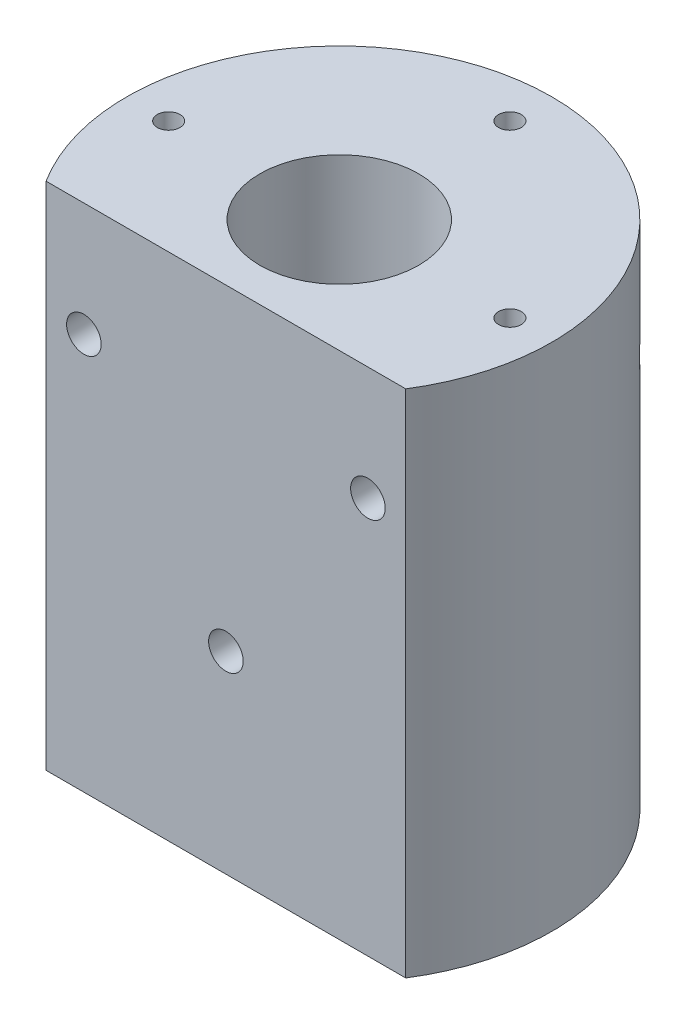
ISO-10303-21;
HEADER;
FILE_DESCRIPTION(('STEP AP214'),'2;1');
FILE_NAME('part.step','',(''),(''),'','','');
FILE_SCHEMA(('AUTOMOTIVE_DESIGN { 1 0 10303 214 1 1 1 1 }'));
ENDSEC;
DATA;
#1=APPLICATION_CONTEXT('core data for automotive mechanical design processes');
#2=APPLICATION_PROTOCOL_DEFINITION('international standard','automotive_design',2000,#1);
#3=PRODUCT_CONTEXT('',#1,'mechanical');
#4=PRODUCT('Part','Part','',(#3));
#5=PRODUCT_RELATED_PRODUCT_CATEGORY('part','',(#4));
#6=PRODUCT_DEFINITION_FORMATION('','',#4);
#7=PRODUCT_DEFINITION_CONTEXT('part definition',#1,'design');
#8=PRODUCT_DEFINITION('design','',#6,#7);
#9=PRODUCT_DEFINITION_SHAPE('','',#8);
#10=(LENGTH_UNIT() NAMED_UNIT(*) SI_UNIT(.MILLI.,.METRE.));
#11=(NAMED_UNIT(*) PLANE_ANGLE_UNIT() SI_UNIT($,.RADIAN.));
#12=(NAMED_UNIT(*) SI_UNIT($,.STERADIAN.) SOLID_ANGLE_UNIT());
#13=UNCERTAINTY_MEASURE_WITH_UNIT(LENGTH_MEASURE(1.E-05),#10,'distance_accuracy_value','');
#14=(GEOMETRIC_REPRESENTATION_CONTEXT(3) GLOBAL_UNCERTAINTY_ASSIGNED_CONTEXT((#13)) GLOBAL_UNIT_ASSIGNED_CONTEXT((#10,
#11,#12)) REPRESENTATION_CONTEXT('',''));
#15=CARTESIAN_POINT('',(0.,0.,0.));
#16=DIRECTION('',(0.,0.,1.));
#17=DIRECTION('',(1.,0.,0.));
#18=AXIS2_PLACEMENT_3D('',#15,#16,#17);
#19=CARTESIAN_POINT('',(0.,-90.,0.));
#20=DIRECTION('',(0.,1.,0.));
#21=DIRECTION('',(0.,0.,1.));
#22=AXIS2_PLACEMENT_3D('',#19,#20,#21);
#23=CYLINDRICAL_SURFACE('',#22,11.2);
#24=CARTESIAN_POINT('',(3.05,-55.95,10.776711001043));
#25=CARTESIAN_POINT('',(3.04999623145743,-56.1178751772108,10.7767137716955));
#26=CARTESIAN_POINT('',(3.03609274985436,-56.2857896702675,10.7806765296159));
#27=CARTESIAN_POINT('',(2.98095760891276,-56.6167595821179,10.7960494721364));
#28=CARTESIAN_POINT('',(2.9397130011288,-56.7798126603492,10.8074631853848));
#29=CARTESIAN_POINT('',(2.8313597380252,-57.0962236473457,10.8363516243342));
#30=CARTESIAN_POINT('',(2.76428851158382,-57.2495952142413,10.8538175752615));
#31=CARTESIAN_POINT('',(2.60630419902693,-57.5429355010534,10.8928312225758));
#32=CARTESIAN_POINT('',(2.5153889717962,-57.6829030157871,10.9143792854753));
#33=CARTESIAN_POINT('',(2.30976133248977,-57.9491124975855,10.9597590800106));
#34=CARTESIAN_POINT('',(2.19453844264803,-58.0749531060746,10.983632672365));
#35=CARTESIAN_POINT('',(1.94466348133748,-58.3057842699961,11.0306128843461));
#36=CARTESIAN_POINT('',(1.81000932479086,-58.4107725849903,11.053719421336));
#37=CARTESIAN_POINT('',(1.52229940129861,-58.5986037356187,11.0970305267987));
#38=CARTESIAN_POINT('',(1.36897303502999,-58.681045899208,11.1171799644357));
#39=CARTESIAN_POINT('',(1.04999469564471,-58.8188286639382,11.1518252926287));
#40=CARTESIAN_POINT('',(0.884344899474339,-58.8741740387204,11.166322178903));
#41=CARTESIAN_POINT('',(0.549612909312948,-58.9548884727968,11.1877329737454));
#42=CARTESIAN_POINT('',(0.38070666942633,-58.9809406624667,11.1948194087348));
#43=CARTESIAN_POINT('',(0.0407822388697001,-59.0044802025124,11.201214773848));
#44=CARTESIAN_POINT('',(-0.130235578567834,-59.0019725307902,11.2005250593327));
#45=CARTESIAN_POINT('',(-0.464767685045948,-58.9689409592804,11.1915715290715));
#46=CARTESIAN_POINT('',(-0.6283610380743,-58.9391553846756,11.1835073254099));
#47=CARTESIAN_POINT('',(-0.9481333287752,-58.8536084415776,11.1609475911081));
#48=CARTESIAN_POINT('',(-1.10431183423155,-58.7978455608943,11.1464516860681));
#49=CARTESIAN_POINT('',(-1.40668474143316,-58.6613719340503,11.1123645238312));
#50=CARTESIAN_POINT('',(-1.55276056241005,-58.5804116284263,11.0927226222307));
#51=CARTESIAN_POINT('',(-1.82950236308129,-58.3960337330169,11.0504546005324));
#52=CARTESIAN_POINT('',(-1.9601652203117,-58.2926116047773,11.0278278777091));
#53=CARTESIAN_POINT('',(-2.20677954911504,-58.0623406038335,10.9811836461871));
#54=CARTESIAN_POINT('',(-2.3221269527727,-57.9348483403712,10.9571448008845));
#55=CARTESIAN_POINT('',(-2.52995523992452,-57.6620826023754,10.9110352423874));
#56=CARTESIAN_POINT('',(-2.62243460284276,-57.5168079463882,10.8889646601318));
#57=CARTESIAN_POINT('',(-2.78238811432387,-57.2112466116065,10.8492020546834));
#58=CARTESIAN_POINT('',(-2.8496913763829,-57.0508662719983,10.8315402161349));
#59=CARTESIAN_POINT('',(-2.95617819602833,-56.7204644088784,10.8029664454447));
#60=CARTESIAN_POINT('',(-2.99536907257209,-56.5504454072044,10.792052756549));
#61=CARTESIAN_POINT('',(-3.04346324801638,-56.2112582796131,10.7785871162836));
#62=CARTESIAN_POINT('',(-3.05327043598141,-56.04222808359,10.7757857117529));
#63=CARTESIAN_POINT('',(-3.04481474777144,-55.7049416408835,10.7781781253564));
#64=CARTESIAN_POINT('',(-3.02655500532632,-55.5366853099003,10.7833710509074));
#65=CARTESIAN_POINT('',(-2.96328205321478,-55.2092509242064,10.8009254057997));
#66=CARTESIAN_POINT('',(-2.91881835419412,-55.0499580081829,10.813139472312));
#67=CARTESIAN_POINT('',(-2.80502059397653,-54.7410925618929,10.8432145080758));
#68=CARTESIAN_POINT('',(-2.73568318323927,-54.591521343974,10.8610762378138));
#69=CARTESIAN_POINT('',(-2.57229099541142,-54.3025804213111,10.9009414192264));
#70=CARTESIAN_POINT('',(-2.47770882751838,-54.1635209687899,10.9230299982747));
#71=CARTESIAN_POINT('',(-2.26716116792455,-53.9029155805311,10.9686626891702));
#72=CARTESIAN_POINT('',(-2.15119147796552,-53.7813730916406,10.9922070861828));
#73=CARTESIAN_POINT('',(-1.8969685487007,-53.5554672956782,11.0389620456436));
#74=CARTESIAN_POINT('',(-1.75814661166884,-53.4517360674235,11.0621408797072));
#75=CARTESIAN_POINT('',(-1.46453848744185,-53.2690457722021,11.1048232958593));
#76=CARTESIAN_POINT('',(-1.30975315027867,-53.1900853871218,11.124327073484));
#77=CARTESIAN_POINT('',(-0.989700904868547,-53.0599134687701,11.1573360820879));
#78=CARTESIAN_POINT('',(-0.824523737653365,-53.0084932485261,11.1708862815792));
#79=CARTESIAN_POINT('',(-0.487446997534502,-52.9342647052504,11.190659568612));
#80=CARTESIAN_POINT('',(-0.315548992797321,-52.9114497483807,11.1968843549674));
#81=CARTESIAN_POINT('',(0.024195701121137,-52.8955096938223,11.2012214285457));
#82=CARTESIAN_POINT('',(0.19199634950391,-52.9014592685654,11.1995865629794));
#83=CARTESIAN_POINT('',(0.52411475476244,-52.9407205883033,11.1889637448709));
#84=CARTESIAN_POINT('',(0.688432652260242,-52.9740312263809,11.1799760897927));
#85=CARTESIAN_POINT('',(1.00775762994188,-53.0665370656362,11.1557114878272));
#86=CARTESIAN_POINT('',(1.16282499723325,-53.1255374181561,11.1404819339187));
#87=CARTESIAN_POINT('',(1.46094745772513,-53.2675743400465,11.1053225720471));
#88=CARTESIAN_POINT('',(1.60400080800345,-53.350614389209,11.0853920836922));
#89=CARTESIAN_POINT('',(1.87831333408396,-53.5410416875994,11.0422716782839));
#90=CARTESIAN_POINT('',(2.00913842610765,-53.649037253602,11.0190070279768));
#91=CARTESIAN_POINT('',(2.2511218193937,-53.8851658380765,10.972131702392));
#92=CARTESIAN_POINT('',(2.36227486227055,-54.0133042235411,10.9485209364176));
#93=CARTESIAN_POINT('',(2.56431965270475,-54.2896578608592,10.9029932749763));
#94=CARTESIAN_POINT('',(2.6546812876738,-54.4382700510584,10.8811284100939));
#95=CARTESIAN_POINT('',(2.80901111907589,-54.7491545440612,10.8423166488308));
#96=CARTESIAN_POINT('',(2.87299587111497,-54.9114182011871,10.8253666695811));
#97=CARTESIAN_POINT('',(2.96479287026685,-55.2191356959455,10.8005504268194));
#98=CARTESIAN_POINT('',(2.99666853431029,-55.3633091105453,10.7916848377547));
#99=CARTESIAN_POINT('',(3.03927242631461,-55.6549785093284,10.7797642725544));
#100=CARTESIAN_POINT('',(3.05000331173282,-55.8024740736299,10.7767085662393));
#101=CARTESIAN_POINT('',(3.05,-55.95,10.776711001043));
#102=B_SPLINE_CURVE_WITH_KNOTS('',3,(#24,#25,#26,#27,#28,#29,#30,#31,#32,#33,#34,#35,#36,#37,
#38,#39,#40,#41,#42,#43,#44,#45,#46,#47,#48,#49,#50,#51,#52,#53,#54,#55,#56,#57,#58,#59,#60,#61,
#62,#63,#64,#65,#66,#67,#68,#69,#70,#71,#72,#73,#74,#75,#76,#77,#78,#79,#80,#81,#82,#83,#84,#85,
#86,#87,#88,#89,#90,#91,#92,#93,#94,#95,#96,#97,#98,#99,#100,#101),.UNSPECIFIED.,.T.,.F.,(4,2,2,
2,2,2,2,2,2,2,2,2,2,2,2,2,2,2,2,2,2,2,2,2,2,2,2,2,2,2,2,2,2,2,2,2,2,2,4),(0.,0.503082789953881,
1.00640400455332,1.50899851643544,2.01163817516342,2.52612725611762,3.04067158558385,
3.56384013602669,4.08691648667009,4.59752364778962,5.10804181290319,5.60513763323398,
6.10226239411082,6.60447646967943,7.10679211311893,7.62517107554222,8.14358449753063,
8.66545548847417,9.1871905628421,9.69270246382814,10.1981579274815,10.693373040537,
11.18865486523,11.6952263401697,12.2018973584719,12.7239197379103,13.2459143346197,
13.7638954280673,14.2817563744414,14.7830711842295,15.2843657138626,15.7819225619858,
16.279551468456,16.7909046262504,17.3023942641936,17.8257549594064,18.3487866622021,
18.7909430622867,19.2330438889954),.UNSPECIFIED.);
#103=CARTESIAN_POINT('',(3.05,-55.95,10.776711001043));
#104=VERTEX_POINT('',#103);
#105=EDGE_CURVE('E166',#104,#104,#102,.T.);
#106=ORIENTED_EDGE('',*,*,#105,.F.);
#107=EDGE_LOOP('',(#106));
#108=FACE_BOUND('',#107,.T.);
#109=CARTESIAN_POINT('',(0.,-90.,0.));
#110=DIRECTION('',(0.,1.,0.));
#111=DIRECTION('',(0.,0.,1.));
#112=AXIS2_PLACEMENT_3D('',#109,#110,#111);
#113=CIRCLE('',#112,11.2);
#114=CARTESIAN_POINT('',(0.,-90.,11.2));
#115=VERTEX_POINT('',#114);
#116=EDGE_CURVE('E85',#115,#115,#113,.T.);
#117=ORIENTED_EDGE('',*,*,#116,.F.);
#118=EDGE_LOOP('',(#117));
#119=FACE_BOUND('',#118,.T.);
#120=CARTESIAN_POINT('',(0.,-50.,0.));
#121=DIRECTION('',(0.,1.,0.));
#122=DIRECTION('',(0.,0.,1.));
#123=AXIS2_PLACEMENT_3D('',#120,#121,#122);
#124=CIRCLE('',#123,11.2);
#125=CARTESIAN_POINT('',(0.,-50.,11.2));
#126=VERTEX_POINT('',#125);
#127=EDGE_CURVE('E172',#126,#126,#124,.T.);
#128=ORIENTED_EDGE('',*,*,#127,.T.);
#129=EDGE_LOOP('',(#128));
#130=FACE_BOUND('',#129,.T.);
#131=ADVANCED_FACE('F39',(#108,#119,#130),#23,.F.);
#132=CARTESIAN_POINT('',(0.,-90.,20.));
#133=DIRECTION('',(0.,0.,1.));
#134=DIRECTION('',(1.,0.,0.));
#135=AXIS2_PLACEMENT_3D('',#132,#133,#134);
#136=PLANE('',#135);
#137=CARTESIAN_POINT('',(0.,-55.95,20.));
#138=DIRECTION('',(0.,0.,1.));
#139=DIRECTION('',(1.,0.,0.));
#140=AXIS2_PLACEMENT_3D('',#137,#138,#139);
#141=CIRCLE('',#140,3.05);
#142=CARTESIAN_POINT('',(3.05,-55.95,20.));
#143=VERTEX_POINT('',#142);
#144=EDGE_CURVE('E229',#143,#143,#141,.T.);
#145=ORIENTED_EDGE('',*,*,#144,.F.);
#146=EDGE_LOOP('',(#145));
#147=FACE_BOUND('',#146,.T.);
#148=CARTESIAN_POINT('',(25.05,-20.05,20.));
#149=DIRECTION('',(0.,0.,1.));
#150=DIRECTION('',(1.,0.,0.));
#151=AXIS2_PLACEMENT_3D('',#148,#149,#150);
#152=CIRCLE('',#151,3.05);
#153=CARTESIAN_POINT('',(28.1,-20.05,20.));
#154=VERTEX_POINT('',#153);
#155=EDGE_CURVE('E92',#154,#154,#152,.T.);
#156=ORIENTED_EDGE('',*,*,#155,.F.);
#157=EDGE_LOOP('',(#156));
#158=FACE_BOUND('',#157,.T.);
#159=CARTESIAN_POINT('',(-25.05,-20.05,20.));
#160=DIRECTION('',(0.,0.,1.));
#161=DIRECTION('',(1.,0.,0.));
#162=AXIS2_PLACEMENT_3D('',#159,#160,#161);
#163=CIRCLE('',#162,3.05);
#164=CARTESIAN_POINT('',(-22.,-20.05,20.));
#165=VERTEX_POINT('',#164);
#166=EDGE_CURVE('E224',#165,#165,#163,.T.);
#167=ORIENTED_EDGE('',*,*,#166,.F.);
#168=EDGE_LOOP('',(#167));
#169=FACE_BOUND('',#168,.T.);
#170=DIRECTION('',(1.,0.,0.));
#171=VECTOR('',#170,1.);
#172=CARTESIAN_POINT('',(0.,0.,20.));
#173=LINE('',#172,#171);
#174=CARTESIAN_POINT('',(-31.7214438511238,0.,20.));
#175=VERTEX_POINT('',#174);
#176=CARTESIAN_POINT('',(31.7214438511238,0.,20.));
#177=VERTEX_POINT('',#176);
#178=EDGE_CURVE('E75',#175,#177,#173,.T.);
#179=ORIENTED_EDGE('',*,*,#178,.F.);
#180=DIRECTION('',(0.,1.,0.));
#181=VECTOR('',#180,1.);
#182=CARTESIAN_POINT('',(-31.7214438511238,-90.,20.));
#183=LINE('',#182,#181);
#184=CARTESIAN_POINT('',(-31.7214438511238,-90.,20.));
#185=VERTEX_POINT('',#184);
#186=EDGE_CURVE('E11',#185,#175,#183,.T.);
#187=ORIENTED_EDGE('',*,*,#186,.F.);
#188=DIRECTION('',(1.,0.,0.));
#189=VECTOR('',#188,1.);
#190=CARTESIAN_POINT('',(0.,-90.,20.));
#191=LINE('',#190,#189);
#192=CARTESIAN_POINT('',(31.7214438511238,-90.,20.));
#193=VERTEX_POINT('',#192);
#194=EDGE_CURVE('E80',#185,#193,#191,.T.);
#195=ORIENTED_EDGE('',*,*,#194,.T.);
#196=DIRECTION('',(0.,1.,0.));
#197=VECTOR('',#196,1.);
#198=CARTESIAN_POINT('',(31.7214438511238,-90.,20.));
#199=LINE('',#198,#197);
#200=EDGE_CURVE('E53',#193,#177,#199,.T.);
#201=ORIENTED_EDGE('',*,*,#200,.T.);
#202=EDGE_LOOP('',(#179,#187,#195,#201));
#203=FACE_BOUND('',#202,.T.);
#204=ADVANCED_FACE('F41',(#147,#158,#169,#203),#136,.T.);
#205=CARTESIAN_POINT('',(0.,-90.,0.));
#206=DIRECTION('',(0.,1.,0.));
#207=DIRECTION('',(0.,0.,1.));
#208=AXIS2_PLACEMENT_3D('',#205,#206,#207);
#209=CYLINDRICAL_SURFACE('',#208,37.5);
#210=CARTESIAN_POINT('',(28.1,-20.05,-24.83223711227));
#211=CARTESIAN_POINT('',(28.0999998195087,-20.1161856596695,-24.8322373521075));
#212=CARTESIAN_POINT('',(28.0978404371829,-20.1823801402648,-24.8346815110146));
#213=CARTESIAN_POINT('',(28.0892566686426,-20.3141659831752,-24.8443897245246));
#214=CARTESIAN_POINT('',(28.0828297758762,-20.3797569680541,-24.8516566117891));
#215=CARTESIAN_POINT('',(28.0658508514684,-20.509839559993,-24.8708298888446));
#216=CARTESIAN_POINT('',(28.0552912024331,-20.5743289061392,-24.88274484571));
#217=CARTESIAN_POINT('',(28.0302908631894,-20.7015993845057,-24.9109041907154));
#218=CARTESIAN_POINT('',(28.0158481562757,-20.7643796103658,-24.9271508285211));
#219=CARTESIAN_POINT('',(27.9674433855617,-20.9483053475669,-24.9814820979298));
#220=CARTESIAN_POINT('',(27.9282148203732,-21.0664158925546,-25.0253741504981));
#221=CARTESIAN_POINT('',(27.8381907308289,-21.292311218697,-25.1254784045173));
#222=CARTESIAN_POINT('',(27.787392910071,-21.4000939438219,-25.1816930518187));
#223=CARTESIAN_POINT('',(27.648757248179,-21.6560650707893,-25.3339962865044));
#224=CARTESIAN_POINT('',(27.5550848382698,-21.7975794077656,-25.4359848311525));
#225=CARTESIAN_POINT('',(27.3524061595352,-22.0571550450112,-25.6538129052575));
#226=CARTESIAN_POINT('',(27.2433605534183,-22.1751542437634,-25.7696878497808));
#227=CARTESIAN_POINT('',(27.0480449925933,-22.357036668635,-25.9743520423836));
#228=CARTESIAN_POINT('',(26.9646411773337,-22.4265792892263,-26.0609528953215));
#229=CARTESIAN_POINT('',(26.7930862158046,-22.5551243399789,-26.2372951204349));
#230=CARTESIAN_POINT('',(26.7049332218278,-22.6141226286731,-26.327037710104));
#231=CARTESIAN_POINT('',(26.5246182441713,-22.7218975796694,-26.5086968899721));
#232=CARTESIAN_POINT('',(26.4324541544405,-22.7706687920487,-26.6006146103941));
#233=CARTESIAN_POINT('',(26.2448106000824,-22.85813816658,-26.7857673420476));
#234=CARTESIAN_POINT('',(26.1493315214923,-22.8968374971931,-26.8790021991509));
#235=CARTESIAN_POINT('',(25.8542616555506,-22.9995284881297,-27.1639974186014));
#236=CARTESIAN_POINT('',(25.6500891372137,-23.0477194362644,-27.3569531504325));
#237=CARTESIAN_POINT('',(25.2345043548916,-23.1016121853976,-27.7407613675125));
#238=CARTESIAN_POINT('',(25.0230947265446,-23.1073292927328,-27.9316145856861));
#239=CARTESIAN_POINT('',(24.6130224985853,-23.0750258469197,-28.2934356185262));
#240=CARTESIAN_POINT('',(24.414523021987,-23.0400879160105,-28.4648521818683));
#241=CARTESIAN_POINT('',(24.0208875304742,-22.9283992945491,-28.7977971206304));
#242=CARTESIAN_POINT('',(23.8257483422855,-22.8516905690715,-28.9593352395715));
#243=CARTESIAN_POINT('',(23.4882024824949,-22.6751067654736,-29.2333861340314));
#244=CARTESIAN_POINT('',(23.3436241231622,-22.5840146953907,-29.3488761980603));
#245=CARTESIAN_POINT('',(23.0662636700093,-22.3732553349133,-29.5673551426022));
#246=CARTESIAN_POINT('',(22.9334663298407,-22.2536257387442,-29.6703602456544));
#247=CARTESIAN_POINT('',(22.7085469370728,-22.0101989035103,-29.842725532065));
#248=CARTESIAN_POINT('',(22.6134177616887,-21.8911039998821,-29.9147986507431));
#249=CARTESIAN_POINT('',(22.4394320233246,-21.6347206834464,-30.0455276179619));
#250=CARTESIAN_POINT('',(22.360570764788,-21.4974375393173,-30.1041873386653));
#251=CARTESIAN_POINT('',(22.2576210139409,-21.2795048298758,-30.1802942414957));
#252=CARTESIAN_POINT('',(22.2257570215307,-21.2045071661399,-30.2037583722552));
#253=CARTESIAN_POINT('',(22.1678210872249,-21.0511248090132,-30.2463055045333));
#254=CARTESIAN_POINT('',(22.1417461855634,-20.9727418709988,-30.2653907449976));
#255=CARTESIAN_POINT('',(22.0958699883706,-20.8132165740171,-30.2989000148495));
#256=CARTESIAN_POINT('',(22.0760663746865,-20.732075246986,-30.3133257666351));
#257=CARTESIAN_POINT('',(22.0431019683565,-20.5677800306774,-30.3373047719201));
#258=CARTESIAN_POINT('',(22.0299401671024,-20.4846264489868,-30.3468587652344));
#259=CARTESIAN_POINT('',(22.0033765277573,-20.2550454197401,-30.3661312998705));
#260=CARTESIAN_POINT('',(21.9969870225568,-20.107276039591,-30.3707525098668));
#261=CARTESIAN_POINT('',(22.0056663297438,-19.8128244397207,-30.3644637831235));
#262=CARTESIAN_POINT('',(22.0207277073692,-19.6661418610297,-30.3535592275322));
#263=CARTESIAN_POINT('',(22.0699332703524,-19.3860486034215,-30.3177982696899));
#264=CARTESIAN_POINT('',(22.1030118751488,-19.2523479013093,-30.2937206285445));
#265=CARTESIAN_POINT('',(22.1857171007936,-18.993163196191,-30.2332030148431));
#266=CARTESIAN_POINT('',(22.2353458891609,-18.8676802720148,-30.1967614230135));
#267=CARTESIAN_POINT('',(22.3521794902719,-18.6202927812203,-30.1103906785372));
#268=CARTESIAN_POINT('',(22.4202450307375,-18.4990306714115,-30.0597953564227));
#269=CARTESIAN_POINT('',(22.569361107287,-18.2702224759387,-29.947998633655));
#270=CARTESIAN_POINT('',(22.650416475327,-18.1626815211122,-29.8867932855893));
#271=CARTESIAN_POINT('',(22.8350242932606,-17.947807088688,-29.7460408348665));
#272=CARTESIAN_POINT('',(22.9401359648307,-17.8427177793076,-29.6651220491263));
#273=CARTESIAN_POINT('',(23.1598314385953,-17.6518789487461,-29.4939263335361));
#274=CARTESIAN_POINT('',(23.2744233049135,-17.5661461287501,-29.4036414196653));
#275=CARTESIAN_POINT('',(23.5664856756204,-17.377028949967,-29.1705361697686));
#276=CARTESIAN_POINT('',(23.7477539039044,-17.2849000689837,-29.0232874789343));
#277=CARTESIAN_POINT('',(24.1164105739104,-17.1396228727253,-28.7177010782965));
#278=CARTESIAN_POINT('',(24.3038075292061,-17.0865314159675,-28.5593475601621));
#279=CARTESIAN_POINT('',(24.6817277086082,-17.016137929356,-28.2334103384766));
#280=CARTESIAN_POINT('',(24.8722584017279,-16.9993396423154,-28.0657294493971));
#281=CARTESIAN_POINT('',(25.2498416913831,-17.0007003907259,-27.7265198532235));
#282=CARTESIAN_POINT('',(25.4368928289233,-17.0188737706204,-27.5549895957438));
#283=CARTESIAN_POINT('',(25.7304420704883,-17.0747627396985,-27.2803440273359));
#284=CARTESIAN_POINT('',(25.8392070783889,-17.1017408263031,-27.1773335990333));
#285=CARTESIAN_POINT('',(26.0536443890465,-17.1676774174305,-26.9718304440323));
#286=CARTESIAN_POINT('',(26.1593159355422,-17.2066388251781,-26.8693378489134));
#287=CARTESIAN_POINT('',(26.3668028665992,-17.2965810686194,-26.6657613252146));
#288=CARTESIAN_POINT('',(26.4686190196921,-17.3475594940538,-26.5646771184539));
#289=CARTESIAN_POINT('',(26.6675808386778,-17.4617420240825,-26.3649390203655));
#290=CARTESIAN_POINT('',(26.7647284484441,-17.524940984286,-26.2662841260194));
#291=CARTESIAN_POINT('',(26.990172216813,-17.6910241323244,-26.0348951723056));
#292=CARTESIAN_POINT('',(27.1159132302929,-17.7997886184198,-25.9038054636767));
#293=CARTESIAN_POINT('',(27.3530526647995,-18.043201022713,-25.6532673268032));
#294=CARTESIAN_POINT('',(27.4644771650734,-18.1778007301528,-25.5337978302994));
#295=CARTESIAN_POINT('',(27.6398835966318,-18.4338184445871,-25.3436140528794));
#296=CARTESIAN_POINT('',(27.7085040164129,-18.5487632230963,-25.2685045725488));
#297=CARTESIAN_POINT('',(27.8323904631592,-18.793218026172,-25.1319819380419));
#298=CARTESIAN_POINT('',(27.8876717943678,-18.922711106614,-25.0705530940529));
#299=CARTESIAN_POINT('',(27.9717276826518,-19.1672761009347,-24.9767013206145));
#300=CARTESIAN_POINT('',(28.0035996690931,-19.2799884554584,-24.9409269836863));
#301=CARTESIAN_POINT('',(28.0544428772444,-19.5116807582739,-24.8837242012915));
#302=CARTESIAN_POINT('',(28.0734468513967,-19.6306439575853,-24.8622593366649));
#303=CARTESIAN_POINT('',(28.0901909907661,-19.8005379153164,-24.8433332949572));
#304=CARTESIAN_POINT('',(28.0938623936403,-19.8502517960888,-24.8391808642622));
#305=CARTESIAN_POINT('',(28.0987672732653,-19.9499753913377,-24.8336323354162));
#306=CARTESIAN_POINT('',(28.1000001363927,-19.9999851770999,-24.8322369310309));
#307=CARTESIAN_POINT('',(28.1,-20.05,-24.83223711227));
#308=B_SPLINE_CURVE_WITH_KNOTS('',3,(#210,#211,#212,#213,#214,#215,#216,#217,#218,#219,#220,
#221,#222,#223,#224,#225,#226,#227,#228,#229,#230,#231,#232,#233,#234,#235,#236,#237,#238,#239,
#240,#241,#242,#243,#244,#245,#246,#247,#248,#249,#250,#251,#252,#253,#254,#255,#256,#257,#258,
#259,#260,#261,#262,#263,#264,#265,#266,#267,#268,#269,#270,#271,#272,#273,#274,#275,#276,#277,
#278,#279,#280,#281,#282,#283,#284,#285,#286,#287,#288,#289,#290,#291,#292,#293,#294,#295,#296,
#297,#298,#299,#300,#301,#302,#303,#304,#305,#306,#307),.UNSPECIFIED.,.T.,.F.,(4,2,2,2,2,2,2,2,
2,2,2,2,2,2,2,2,2,2,2,2,2,2,2,2,2,2,2,2,2,2,2,2,2,2,2,2,2,2,2,2,2,2,2,2,2,2,2,2,4),(0.,
0.19849277418934,0.39710223774229,0.596079510543532,0.795160324503009,1.18915185784029,
1.5832216635148,2.17392344907614,2.76616513693792,3.18234611401628,3.59869019579217,
4.01525558313841,4.43177262224743,5.28332930067119,6.13457908794559,6.92526979968811,
7.71516760479472,8.3316529926581,8.94732855178162,9.45119381334763,9.95491343557821,
10.2089889457424,10.4629342550397,10.7167855847551,10.9705983536611,11.4120023253009,
11.8532533458958,12.2708645827694,12.6885305342036,13.1307142061007,13.5730627449125,
14.0788866619558,14.5851453606594,15.3342153082524,16.0843741364244,16.8448798804559,
17.6056976301164,18.0619008492767,18.5182146809458,18.9744370672774,19.430467817416,
20.0636011673787,20.6955643247217,21.1545803901845,21.6130672848046,21.9790754826277,
22.344148556817,22.4941067775467,22.644102728295),.UNSPECIFIED.);
#309=CARTESIAN_POINT('',(28.1,-20.05,-24.83223711227));
#310=VERTEX_POINT('',#309);
#311=EDGE_CURVE('E43',#310,#310,#308,.T.);
#312=ORIENTED_EDGE('',*,*,#311,.F.);
#313=EDGE_LOOP('',(#312));
#314=FACE_BOUND('',#313,.T.);
#315=CARTESIAN_POINT('',(-22.,-20.05,-30.3685692781204));
#316=CARTESIAN_POINT('',(-22.0000081153623,-20.1966973527756,-30.3685642401916));
#317=CARTESIAN_POINT('',(-22.0106641959872,-20.343634596102,-30.3608525361161));
#318=CARTESIAN_POINT('',(-22.0526713144488,-20.6331106545424,-30.330353281018));
#319=CARTESIAN_POINT('',(-22.0840727656356,-20.7756378673705,-30.3075290046124));
#320=CARTESIAN_POINT('',(-22.1655310494322,-21.0514593870505,-30.2480038764233));
#321=CARTESIAN_POINT('',(-22.2155060380976,-21.1847912018055,-30.2113638931327));
#322=CARTESIAN_POINT('',(-22.3314678997106,-21.4398674956351,-30.1257483430134));
#323=CARTESIAN_POINT('',(-22.3974499997781,-21.5616154136718,-30.0767764530549));
#324=CARTESIAN_POINT('',(-22.5469104736873,-21.7986680255792,-29.9649131211138));
#325=CARTESIAN_POINT('',(-22.6312032575617,-21.9131430520323,-29.9013609830507));
#326=CARTESIAN_POINT('',(-22.8111853737168,-22.1259756801451,-29.7642850416448));
#327=CARTESIAN_POINT('',(-22.9068820403508,-22.2243228115708,-29.6907548166792));
#328=CARTESIAN_POINT('',(-23.1506281437447,-22.4442385393021,-29.5013790379345));
#329=CARTESIAN_POINT('',(-23.3032107616102,-22.5570339962573,-29.3811327395962));
#330=CARTESIAN_POINT('',(-23.6186140115512,-22.749615856508,-29.1282029330724));
#331=CARTESIAN_POINT('',(-23.7814540016347,-22.8293375531641,-28.9954956617395));
#332=CARTESIAN_POINT('',(-24.1545723679332,-22.9741091241818,-28.6858733739003));
#333=CARTESIAN_POINT('',(-24.3662454637441,-23.0300592928814,-28.5063896713405));
#334=CARTESIAN_POINT('',(-24.7893971926774,-23.0963981508457,-28.1391997016443));
#335=CARTESIAN_POINT('',(-25.0008755936681,-23.1067556417257,-27.9514878928207));
#336=CARTESIAN_POINT('',(-25.4207739650321,-23.0847587831193,-27.5701949664187));
#337=CARTESIAN_POINT('',(-25.6291259210325,-23.0518858685016,-27.3765703058259));
#338=CARTESIAN_POINT('',(-26.0356480683219,-22.9440010348516,-26.9902498020004));
#339=CARTESIAN_POINT('',(-26.2338178848162,-22.8689875658771,-26.7975539931941));
#340=CARTESIAN_POINT('',(-26.592300165143,-22.6880203159027,-26.4415506524229));
#341=CARTESIAN_POINT('',(-26.7542987121927,-22.5868753772617,-26.2774968104023));
#342=CARTESIAN_POINT('',(-27.0625938924237,-22.3499324032569,-25.9598659810368));
#343=CARTESIAN_POINT('',(-27.2089155841178,-22.2141908786765,-25.8062724212197));
#344=CARTESIAN_POINT('',(-27.4358215189811,-21.955176149242,-25.564503189612));
#345=CARTESIAN_POINT('',(-27.5224029174728,-21.8419599621475,-25.4711870766567));
#346=CARTESIAN_POINT('',(-27.6822416002417,-21.5975915870554,-25.2973782363429));
#347=CARTESIAN_POINT('',(-27.7555193982647,-21.4664675690486,-25.2168657903202));
#348=CARTESIAN_POINT('',(-27.8702165973913,-21.2175981427744,-25.0899718835445));
#349=CARTESIAN_POINT('',(-27.9150976952542,-21.1033042782316,-25.0399799142548));
#350=CARTESIAN_POINT('',(-27.9916969769236,-20.8651538481879,-24.9543228555675));
#351=CARTESIAN_POINT('',(-28.023425860762,-20.7413051537453,-24.918646120718));
#352=CARTESIAN_POINT('',(-28.0594375408255,-20.5500759618837,-24.8780683575672));
#353=CARTESIAN_POINT('',(-28.0695319515483,-20.4850868821812,-24.866674850647));
#354=CARTESIAN_POINT('',(-28.0855328844593,-20.3539596941026,-24.8486014059097));
#355=CARTESIAN_POINT('',(-28.0914414960411,-20.2878221758991,-24.8419191164379));
#356=CARTESIAN_POINT('',(-28.0989171599318,-20.1550064143302,-24.8334630573559));
#357=CARTESIAN_POINT('',(-28.1004854750413,-20.0883283339041,-24.8316878600371));
#358=CARTESIAN_POINT('',(-28.099252067593,-19.9550862494741,-24.8330833580428));
#359=CARTESIAN_POINT('',(-28.0964507689779,-19.8885222350308,-24.8362535735601));
#360=CARTESIAN_POINT('',(-28.0828927870292,-19.7075864140385,-24.851586137311));
#361=CARTESIAN_POINT('',(-28.0678130433956,-19.5938951992047,-24.8686328638471));
#362=CARTESIAN_POINT('',(-28.0257766213255,-19.3716961531007,-24.9159952708151));
#363=CARTESIAN_POINT('',(-27.9988146564537,-19.2631906528143,-24.9463168572317));
#364=CARTESIAN_POINT('',(-27.9243805585574,-19.0197774152488,-25.0296419317823));
#365=CARTESIAN_POINT('',(-27.8731122438872,-18.8874519860678,-25.0867924790965));
#366=CARTESIAN_POINT('',(-27.7564750595085,-18.6369578669168,-25.215782172026));
#367=CARTESIAN_POINT('',(-27.691078750251,-18.5188174318777,-25.2876498871341));
#368=CARTESIAN_POINT('',(-27.5201196860254,-18.2512269151396,-25.4738054661559));
#369=CARTESIAN_POINT('',(-27.4091141565477,-18.1089557456276,-25.5933649889733));
#370=CARTESIAN_POINT('',(-27.1714671014897,-17.8516733069907,-25.8455322579319));
#371=CARTESIAN_POINT('',(-27.0447965183249,-17.7367138884065,-25.978164157072));
#372=CARTESIAN_POINT('',(-26.8220486150381,-17.5649808865579,-26.2077206036261));
#373=CARTESIAN_POINT('',(-26.7290431395881,-17.5013266974127,-26.3025965176777));
#374=CARTESIAN_POINT('',(-26.5384819310296,-17.3855374965393,-26.494853921162));
#375=CARTESIAN_POINT('',(-26.4409246508634,-17.333406436319,-26.5922362573552));
#376=CARTESIAN_POINT('',(-26.2419780456915,-17.2404182442404,-26.7885820528461));
#377=CARTESIAN_POINT('',(-26.1405863276225,-17.1995682894489,-26.8875464765176));
#378=CARTESIAN_POINT('',(-25.9347149796061,-17.1291073611318,-27.0861785547428));
#379=CARTESIAN_POINT('',(-25.8302356919384,-17.0994951468204,-27.1858461304213));
#380=CARTESIAN_POINT('',(-25.5099822559029,-17.0268695511598,-27.4877671009294));
#381=CARTESIAN_POINT('',(-25.2901430498297,-17.0013432120755,-27.6902168458845));
#382=CARTESIAN_POINT('',(-24.845603949126,-16.9987615220151,-28.0897694665927));
#383=CARTESIAN_POINT('',(-24.6209086924182,-17.0216617831458,-28.2868770712272));
#384=CARTESIAN_POINT('',(-24.215398600503,-17.1105142786308,-28.6342793996553));
#385=CARTESIAN_POINT('',(-24.0342429413785,-17.16760543207,-28.7864304854005));
#386=CARTESIAN_POINT('',(-23.6785390377628,-17.3189116627013,-29.0797119159606));
#387=CARTESIAN_POINT('',(-23.5039830197647,-17.4130814719499,-29.2208554486885));
#388=CARTESIAN_POINT('',(-23.203804533521,-17.6169410801726,-29.4595031594504));
#389=CARTESIAN_POINT('',(-23.075568160594,-17.7193002747753,-29.5599700623746));
#390=CARTESIAN_POINT('',(-22.8326952742457,-17.9490696908969,-29.7479665784984));
#391=CARTESIAN_POINT('',(-22.7180430708365,-18.0764505506434,-29.8355111465736));
#392=CARTESIAN_POINT('',(-22.5256920366154,-18.3320008547868,-29.9809153880338));
#393=CARTESIAN_POINT('',(-22.4450193081575,-18.4564932828029,-30.0412908319561));
#394=CARTESIAN_POINT('',(-22.300888054165,-18.72054724676,-30.1484406370606));
#395=CARTESIAN_POINT('',(-22.2374239957503,-18.8601039190664,-30.1952193701655));
#396=CARTESIAN_POINT('',(-22.1369625554962,-19.1357075581718,-30.2689341476667));
#397=CARTESIAN_POINT('',(-22.0978817493599,-19.2705763274561,-30.2974410764658));
#398=CARTESIAN_POINT('',(-22.038585065399,-19.5463522076222,-30.3406022374765));
#399=CARTESIAN_POINT('',(-22.0183217426857,-19.6872431901808,-30.3552913101394));
#400=CARTESIAN_POINT('',(-22.0053447443222,-19.8657652846475,-30.364696655368));
#401=CARTESIAN_POINT('',(-22.0033427058034,-19.9025633167881,-30.3661474847929));
#402=CARTESIAN_POINT('',(-22.0006692539927,-19.9762358383612,-30.3680844725793));
#403=CARTESIAN_POINT('',(-21.9999979592474,-20.0131103343125,-30.3685705449975));
#404=CARTESIAN_POINT('',(-22.,-20.05,-30.3685692781204));
#405=B_SPLINE_CURVE_WITH_KNOTS('',3,(#315,#316,#317,#318,#319,#320,#321,#322,#323,#324,#325,
#326,#327,#328,#329,#330,#331,#332,#333,#334,#335,#336,#337,#338,#339,#340,#341,#342,#343,#344,
#345,#346,#347,#348,#349,#350,#351,#352,#353,#354,#355,#356,#357,#358,#359,#360,#361,#362,#363,
#364,#365,#366,#367,#368,#369,#370,#371,#372,#373,#374,#375,#376,#377,#378,#379,#380,#381,#382,
#383,#384,#385,#386,#387,#388,#389,#390,#391,#392,#393,#394,#395,#396,#397,#398,#399,#400,#401,
#402,#403,#404),.UNSPECIFIED.,.T.,.F.,(4,2,2,2,2,2,2,2,2,2,2,2,2,2,2,2,2,2,2,2,2,2,2,2,2,2,2,2,
2,2,2,2,2,2,2,2,2,2,2,2,2,2,2,2,4),(0.,0.439936186969096,0.880945415369924,1.32003395078416,
1.75899172264972,2.22438652446852,2.690082274779,3.36032026488748,4.03186341727494,
4.87675830742032,5.72223125666323,6.57793906154645,7.43367834168281,8.18645260272616,
8.93800505996055,9.44758176878133,9.95636592561253,10.3526632759633,10.7486375813599,
10.9486216758022,11.1485058752266,11.348331912623,11.5481385639764,11.8942411030547,
12.2404977798691,12.6969104614901,13.1542176927082,13.8001075170156,14.4472139166585,
14.8886562264047,15.3302496813713,15.7721234353141,16.2139483867142,17.1096875863782,
18.0046061060643,18.7320090803594,19.4585267355254,20.0335533529415,20.6079091911864,
21.0864431087619,21.5648229866181,21.9928229471016,22.4197408295244,22.5303607760461,
22.6409905764756),.UNSPECIFIED.);
#406=CARTESIAN_POINT('',(-22.,-20.05,-30.3685692781204));
#407=VERTEX_POINT('',#406);
#408=EDGE_CURVE('E86',#407,#407,#405,.T.);
#409=ORIENTED_EDGE('',*,*,#408,.F.);
#410=EDGE_LOOP('',(#409));
#411=FACE_BOUND('',#410,.T.);
#412=CARTESIAN_POINT('',(0.,0.,0.));
#413=DIRECTION('',(0.,1.,0.));
#414=DIRECTION('',(0.,0.,1.));
#415=AXIS2_PLACEMENT_3D('',#412,#413,#414);
#416=CIRCLE('',#415,37.5);
#417=EDGE_CURVE('E72',#177,#175,#416,.T.);
#418=ORIENTED_EDGE('',*,*,#417,.F.);
#419=ORIENTED_EDGE('',*,*,#200,.F.);
#420=CARTESIAN_POINT('',(0.,-90.,0.));
#421=DIRECTION('',(0.,1.,0.));
#422=DIRECTION('',(0.,0.,1.));
#423=AXIS2_PLACEMENT_3D('',#420,#421,#422);
#424=CIRCLE('',#423,37.5);
#425=EDGE_CURVE('E74',#193,#185,#424,.T.);
#426=ORIENTED_EDGE('',*,*,#425,.T.);
#427=ORIENTED_EDGE('',*,*,#186,.T.);
#428=EDGE_LOOP('',(#418,#419,#426,#427));
#429=FACE_BOUND('',#428,.T.);
#430=ADVANCED_FACE('F70',(#314,#411,#429),#209,.T.);
#431=CARTESIAN_POINT('',(0.,-90.,0.));
#432=DIRECTION('',(0.,1.,0.));
#433=DIRECTION('',(0.,0.,1.));
#434=AXIS2_PLACEMENT_3D('',#431,#432,#433);
#435=PLANE('',#434);
#436=CARTESIAN_POINT('',(-25.,-90.,0.));
#437=DIRECTION('',(0.,-1.,0.));
#438=DIRECTION('',(0.,0.,-1.));
#439=AXIS2_PLACEMENT_3D('',#436,#437,#438);
#440=CIRCLE('',#439,2.5);
#441=CARTESIAN_POINT('',(-25.,-90.,-2.5));
#442=VERTEX_POINT('',#441);
#443=EDGE_CURVE('E219',#442,#442,#440,.T.);
#444=ORIENTED_EDGE('',*,*,#443,.F.);
#445=EDGE_LOOP('',(#444));
#446=FACE_BOUND('',#445,.T.);
#447=CARTESIAN_POINT('',(25.,-90.,0.));
#448=DIRECTION('',(0.,-1.,0.));
#449=DIRECTION('',(0.,0.,-1.));
#450=AXIS2_PLACEMENT_3D('',#447,#448,#449);
#451=CIRCLE('',#450,2.5);
#452=CARTESIAN_POINT('',(25.,-90.,-2.5));
#453=VERTEX_POINT('',#452);
#454=EDGE_CURVE('E183',#453,#453,#451,.T.);
#455=ORIENTED_EDGE('',*,*,#454,.F.);
#456=EDGE_LOOP('',(#455));
#457=FACE_BOUND('',#456,.T.);
#458=ORIENTED_EDGE('',*,*,#194,.F.);
#459=ORIENTED_EDGE('',*,*,#425,.F.);
#460=EDGE_LOOP('',(#458,#459));
#461=FACE_BOUND('',#460,.T.);
#462=ORIENTED_EDGE('',*,*,#116,.T.);
#463=EDGE_LOOP('',(#462));
#464=FACE_BOUND('',#463,.T.);
#465=ADVANCED_FACE('F151',(#446,#457,#461,#464),#435,.F.);
#466=CARTESIAN_POINT('',(0.,0.,0.));
#467=DIRECTION('',(0.,1.,0.));
#468=DIRECTION('',(0.,0.,1.));
#469=AXIS2_PLACEMENT_3D('',#466,#467,#468);
#470=PLANE('',#469);
#471=CARTESIAN_POINT('',(0.,0.,0.));
#472=DIRECTION('',(0.,1.,0.));
#473=DIRECTION('',(0.,0.,1.));
#474=AXIS2_PLACEMENT_3D('',#471,#472,#473);
#475=CIRCLE('',#474,14.);
#476=CARTESIAN_POINT('',(0.,0.,14.));
#477=VERTEX_POINT('',#476);
#478=EDGE_CURVE('E174',#477,#477,#475,.T.);
#479=ORIENTED_EDGE('',*,*,#478,.F.);
#480=EDGE_LOOP('',(#479));
#481=FACE_BOUND('',#480,.T.);
#482=CARTESIAN_POINT('',(-30.1,0.,0.));
#483=DIRECTION('',(0.,1.,0.));
#484=DIRECTION('',(0.,0.,1.));
#485=AXIS2_PLACEMENT_3D('',#482,#483,#484);
#486=CIRCLE('',#485,2.);
#487=CARTESIAN_POINT('',(-30.1,0.,2.));
#488=VERTEX_POINT('',#487);
#489=EDGE_CURVE('E188',#488,#488,#486,.T.);
#490=ORIENTED_EDGE('',*,*,#489,.F.);
#491=EDGE_LOOP('',(#490));
#492=FACE_BOUND('',#491,.T.);
#493=CARTESIAN_POINT('',(0.,0.,-30.1));
#494=DIRECTION('',(0.,1.,0.));
#495=DIRECTION('',(0.,0.,1.));
#496=AXIS2_PLACEMENT_3D('',#493,#494,#495);
#497=CIRCLE('',#496,2.);
#498=CARTESIAN_POINT('',(0.,0.,-28.1));
#499=VERTEX_POINT('',#498);
#500=EDGE_CURVE('E194',#499,#499,#497,.T.);
#501=ORIENTED_EDGE('',*,*,#500,.F.);
#502=EDGE_LOOP('',(#501));
#503=FACE_BOUND('',#502,.T.);
#504=CARTESIAN_POINT('',(30.1,0.,0.));
#505=DIRECTION('',(0.,1.,0.));
#506=DIRECTION('',(0.,0.,1.));
#507=AXIS2_PLACEMENT_3D('',#504,#505,#506);
#508=CIRCLE('',#507,2.);
#509=CARTESIAN_POINT('',(30.1,0.,2.));
#510=VERTEX_POINT('',#509);
#511=EDGE_CURVE('E177',#510,#510,#508,.T.);
#512=ORIENTED_EDGE('',*,*,#511,.F.);
#513=EDGE_LOOP('',(#512));
#514=FACE_BOUND('',#513,.T.);
#515=ORIENTED_EDGE('',*,*,#178,.T.);
#516=ORIENTED_EDGE('',*,*,#417,.T.);
#517=EDGE_LOOP('',(#515,#516));
#518=FACE_BOUND('',#517,.T.);
#519=ADVANCED_FACE('F79',(#481,#492,#503,#514,#518),#470,.T.);
#520=CARTESIAN_POINT('',(30.1,-14.6,0.));
#521=DIRECTION('',(0.,1.,0.));
#522=DIRECTION('',(0.,0.,1.));
#523=AXIS2_PLACEMENT_3D('',#520,#521,#522);
#524=CYLINDRICAL_SURFACE('',#523,2.);
#525=CARTESIAN_POINT('',(30.1,-14.6,0.));
#526=DIRECTION('',(0.,1.,0.));
#527=DIRECTION('',(0.,0.,1.));
#528=AXIS2_PLACEMENT_3D('',#525,#526,#527);
#529=CIRCLE('',#528,2.);
#530=CARTESIAN_POINT('',(30.1,-14.6,2.));
#531=VERTEX_POINT('',#530);
#532=EDGE_CURVE('E197',#531,#531,#529,.T.);
#533=ORIENTED_EDGE('',*,*,#532,.F.);
#534=EDGE_LOOP('',(#533));
#535=FACE_BOUND('',#534,.T.);
#536=ORIENTED_EDGE('',*,*,#511,.T.);
#537=EDGE_LOOP('',(#536));
#538=FACE_BOUND('',#537,.T.);
#539=ADVANCED_FACE('F146',(#535,#538),#524,.F.);
#540=CARTESIAN_POINT('',(0.,-14.6,0.));
#541=DIRECTION('',(0.,1.,0.));
#542=DIRECTION('',(0.,0.,1.));
#543=AXIS2_PLACEMENT_3D('',#540,#541,#542);
#544=PLANE('',#543);
#545=ORIENTED_EDGE('',*,*,#532,.T.);
#546=EDGE_LOOP('',(#545));
#547=FACE_BOUND('',#546,.T.);
#548=ADVANCED_FACE('F142',(#547),#544,.T.);
#549=CARTESIAN_POINT('',(0.,-14.6,-30.1));
#550=DIRECTION('',(0.,1.,0.));
#551=DIRECTION('',(0.,0.,1.));
#552=AXIS2_PLACEMENT_3D('',#549,#550,#551);
#553=CYLINDRICAL_SURFACE('',#552,2.);
#554=CARTESIAN_POINT('',(0.,-14.6,-30.1));
#555=DIRECTION('',(0.,1.,0.));
#556=DIRECTION('',(0.,0.,1.));
#557=AXIS2_PLACEMENT_3D('',#554,#555,#556);
#558=CIRCLE('',#557,2.);
#559=CARTESIAN_POINT('',(0.,-14.6,-28.1));
#560=VERTEX_POINT('',#559);
#561=EDGE_CURVE('E191',#560,#560,#558,.T.);
#562=ORIENTED_EDGE('',*,*,#561,.F.);
#563=EDGE_LOOP('',(#562));
#564=FACE_BOUND('',#563,.T.);
#565=ORIENTED_EDGE('',*,*,#500,.T.);
#566=EDGE_LOOP('',(#565));
#567=FACE_BOUND('',#566,.T.);
#568=ADVANCED_FACE('F138',(#564,#567),#553,.F.);
#569=CARTESIAN_POINT('',(0.,-14.6,0.));
#570=DIRECTION('',(0.,1.,0.));
#571=DIRECTION('',(0.,0.,1.));
#572=AXIS2_PLACEMENT_3D('',#569,#570,#571);
#573=PLANE('',#572);
#574=ORIENTED_EDGE('',*,*,#561,.T.);
#575=EDGE_LOOP('',(#574));
#576=FACE_BOUND('',#575,.T.);
#577=ADVANCED_FACE('F134',(#576),#573,.T.);
#578=CARTESIAN_POINT('',(-30.1,-14.6,0.));
#579=DIRECTION('',(0.,1.,0.));
#580=DIRECTION('',(0.,0.,1.));
#581=AXIS2_PLACEMENT_3D('',#578,#579,#580);
#582=CYLINDRICAL_SURFACE('',#581,2.);
#583=CARTESIAN_POINT('',(-30.1,-14.6,0.));
#584=DIRECTION('',(0.,1.,0.));
#585=DIRECTION('',(0.,0.,1.));
#586=AXIS2_PLACEMENT_3D('',#583,#584,#585);
#587=CIRCLE('',#586,2.);
#588=CARTESIAN_POINT('',(-30.1,-14.6,2.));
#589=VERTEX_POINT('',#588);
#590=EDGE_CURVE('E77',#589,#589,#587,.T.);
#591=ORIENTED_EDGE('',*,*,#590,.F.);
#592=EDGE_LOOP('',(#591));
#593=FACE_BOUND('',#592,.T.);
#594=ORIENTED_EDGE('',*,*,#489,.T.);
#595=EDGE_LOOP('',(#594));
#596=FACE_BOUND('',#595,.T.);
#597=ADVANCED_FACE('F130',(#593,#596),#582,.F.);
#598=CARTESIAN_POINT('',(0.,-14.6,0.));
#599=DIRECTION('',(0.,1.,0.));
#600=DIRECTION('',(0.,0.,1.));
#601=AXIS2_PLACEMENT_3D('',#598,#599,#600);
#602=PLANE('',#601);
#603=ORIENTED_EDGE('',*,*,#590,.T.);
#604=EDGE_LOOP('',(#603));
#605=FACE_BOUND('',#604,.T.);
#606=ADVANCED_FACE('F126',(#605),#602,.T.);
#607=CARTESIAN_POINT('',(0.,-50.,0.));
#608=DIRECTION('',(0.,1.,0.));
#609=DIRECTION('',(0.,0.,1.));
#610=AXIS2_PLACEMENT_3D('',#607,#608,#609);
#611=CYLINDRICAL_SURFACE('',#610,14.);
#612=CARTESIAN_POINT('',(0.,-50.,0.));
#613=DIRECTION('',(0.,1.,0.));
#614=DIRECTION('',(0.,0.,1.));
#615=AXIS2_PLACEMENT_3D('',#612,#613,#614);
#616=CIRCLE('',#615,14.);
#617=CARTESIAN_POINT('',(0.,-50.,14.));
#618=VERTEX_POINT('',#617);
#619=EDGE_CURVE('E173',#618,#618,#616,.T.);
#620=ORIENTED_EDGE('',*,*,#619,.F.);
#621=EDGE_LOOP('',(#620));
#622=FACE_BOUND('',#621,.T.);
#623=ORIENTED_EDGE('',*,*,#478,.T.);
#624=EDGE_LOOP('',(#623));
#625=FACE_BOUND('',#624,.T.);
#626=ADVANCED_FACE('F122',(#622,#625),#611,.F.);
#627=CARTESIAN_POINT('',(0.,-50.,0.));
#628=DIRECTION('',(0.,1.,0.));
#629=DIRECTION('',(0.,0.,1.));
#630=AXIS2_PLACEMENT_3D('',#627,#628,#629);
#631=PLANE('',#630);
#632=ORIENTED_EDGE('',*,*,#127,.F.);
#633=EDGE_LOOP('',(#632));
#634=FACE_BOUND('',#633,.T.);
#635=ORIENTED_EDGE('',*,*,#619,.T.);
#636=EDGE_LOOP('',(#635));
#637=FACE_BOUND('',#636,.T.);
#638=ADVANCED_FACE('F118',(#634,#637),#631,.T.);
#639=CARTESIAN_POINT('',(25.,-67.,0.));
#640=DIRECTION('',(0.,-1.,0.));
#641=DIRECTION('',(0.,0.,-1.));
#642=AXIS2_PLACEMENT_3D('',#639,#640,#641);
#643=CYLINDRICAL_SURFACE('',#642,2.5);
#644=CARTESIAN_POINT('',(25.,-67.,0.));
#645=DIRECTION('',(0.,-1.,0.));
#646=DIRECTION('',(0.,0.,-1.));
#647=AXIS2_PLACEMENT_3D('',#644,#645,#646);
#648=CIRCLE('',#647,2.5);
#649=CARTESIAN_POINT('',(25.,-67.,-2.5));
#650=VERTEX_POINT('',#649);
#651=EDGE_CURVE('E216',#650,#650,#648,.T.);
#652=ORIENTED_EDGE('',*,*,#651,.F.);
#653=EDGE_LOOP('',(#652));
#654=FACE_BOUND('',#653,.T.);
#655=ORIENTED_EDGE('',*,*,#454,.T.);
#656=EDGE_LOOP('',(#655));
#657=FACE_BOUND('',#656,.T.);
#658=ADVANCED_FACE('F114',(#654,#657),#643,.F.);
#659=CARTESIAN_POINT('',(25.,-67.,0.));
#660=DIRECTION('',(0.,-1.,0.));
#661=DIRECTION('',(0.,0.,-1.));
#662=AXIS2_PLACEMENT_3D('',#659,#660,#661);
#663=PLANE('',#662);
#664=ORIENTED_EDGE('',*,*,#651,.T.);
#665=EDGE_LOOP('',(#664));
#666=FACE_BOUND('',#665,.T.);
#667=ADVANCED_FACE('F110',(#666),#663,.T.);
#668=CARTESIAN_POINT('',(-25.,-67.,0.));
#669=DIRECTION('',(0.,-1.,0.));
#670=DIRECTION('',(0.,0.,-1.));
#671=AXIS2_PLACEMENT_3D('',#668,#669,#670);
#672=CYLINDRICAL_SURFACE('',#671,2.5);
#673=CARTESIAN_POINT('',(-25.,-67.,0.));
#674=DIRECTION('',(0.,-1.,0.));
#675=DIRECTION('',(0.,0.,-1.));
#676=AXIS2_PLACEMENT_3D('',#673,#674,#675);
#677=CIRCLE('',#676,2.5);
#678=CARTESIAN_POINT('',(-25.,-67.,-2.5));
#679=VERTEX_POINT('',#678);
#680=EDGE_CURVE('E180',#679,#679,#677,.T.);
#681=ORIENTED_EDGE('',*,*,#680,.F.);
#682=EDGE_LOOP('',(#681));
#683=FACE_BOUND('',#682,.T.);
#684=ORIENTED_EDGE('',*,*,#443,.T.);
#685=EDGE_LOOP('',(#684));
#686=FACE_BOUND('',#685,.T.);
#687=ADVANCED_FACE('F106',(#683,#686),#672,.F.);
#688=CARTESIAN_POINT('',(-25.,-67.,0.));
#689=DIRECTION('',(0.,-1.,0.));
#690=DIRECTION('',(0.,0.,-1.));
#691=AXIS2_PLACEMENT_3D('',#688,#689,#690);
#692=PLANE('',#691);
#693=ORIENTED_EDGE('',*,*,#680,.T.);
#694=EDGE_LOOP('',(#693));
#695=FACE_BOUND('',#694,.T.);
#696=ADVANCED_FACE('F100',(#695),#692,.T.);
#697=CARTESIAN_POINT('',(-25.05,-20.05,-37.5));
#698=DIRECTION('',(0.,0.,1.));
#699=DIRECTION('',(1.,0.,0.));
#700=AXIS2_PLACEMENT_3D('',#697,#698,#699);
#701=CYLINDRICAL_SURFACE('',#700,3.05);
#702=ORIENTED_EDGE('',*,*,#408,.T.);
#703=EDGE_LOOP('',(#702));
#704=FACE_BOUND('',#703,.T.);
#705=ORIENTED_EDGE('',*,*,#166,.T.);
#706=EDGE_LOOP('',(#705));
#707=FACE_BOUND('',#706,.T.);
#708=ADVANCED_FACE('F95',(#704,#707),#701,.F.);
#709=CARTESIAN_POINT('',(25.05,-20.05,-37.5));
#710=DIRECTION('',(0.,0.,1.));
#711=DIRECTION('',(1.,0.,0.));
#712=AXIS2_PLACEMENT_3D('',#709,#710,#711);
#713=CYLINDRICAL_SURFACE('',#712,3.05);
#714=ORIENTED_EDGE('',*,*,#311,.T.);
#715=EDGE_LOOP('',(#714));
#716=FACE_BOUND('',#715,.T.);
#717=ORIENTED_EDGE('',*,*,#155,.T.);
#718=EDGE_LOOP('',(#717));
#719=FACE_BOUND('',#718,.T.);
#720=ADVANCED_FACE('F99',(#716,#719),#713,.F.);
#721=CARTESIAN_POINT('',(0.,-55.95,-37.501));
#722=DIRECTION('',(0.,0.,1.));
#723=DIRECTION('',(1.,0.,0.));
#724=AXIS2_PLACEMENT_3D('',#721,#722,#723);
#725=CYLINDRICAL_SURFACE('',#724,3.05);
#726=ORIENTED_EDGE('',*,*,#144,.T.);
#727=EDGE_LOOP('',(#726));
#728=FACE_BOUND('',#727,.T.);
#729=ORIENTED_EDGE('',*,*,#105,.T.);
#730=EDGE_LOOP('',(#729));
#731=FACE_BOUND('',#730,.T.);
#732=ADVANCED_FACE('F236',(#728,#731),#725,.F.);
#733=CLOSED_SHELL('',(#131,#204,#430,#465,#519,#539,#548,#568,#577,#597,#606,#626,#638,#658,
#667,#687,#696,#708,#720,#732));
#734=MANIFOLD_SOLID_BREP('B2',#733);
#735=ADVANCED_BREP_SHAPE_REPRESENTATION('',(#18,#734),#14);
#736=SHAPE_DEFINITION_REPRESENTATION(#9,#735);
ENDSEC;
END-ISO-10303-21;
